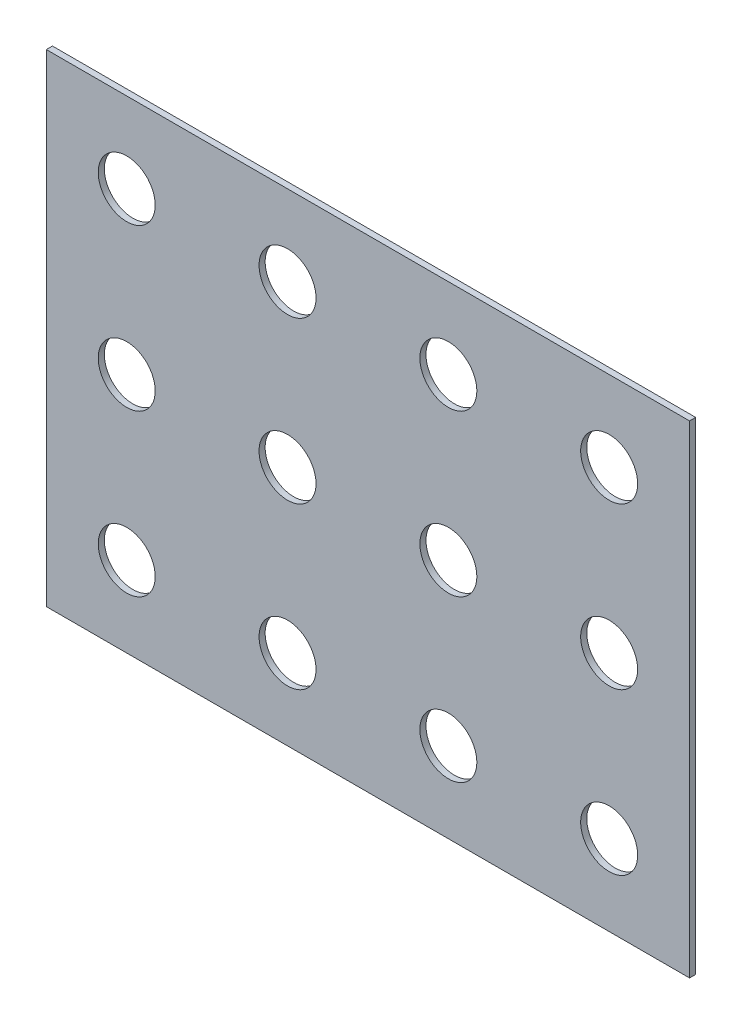
ISO-10303-21;
HEADER;
FILE_DESCRIPTION(('STEP AP214'),'2;1');
FILE_NAME('part.step','',(''),(''),'','','');
FILE_SCHEMA(('AUTOMOTIVE_DESIGN { 1 0 10303 214 1 1 1 1 }'));
ENDSEC;
DATA;
#1=APPLICATION_CONTEXT('core data for automotive mechanical design processes');
#2=APPLICATION_PROTOCOL_DEFINITION('international standard','automotive_design',2000,#1);
#3=PRODUCT_CONTEXT('',#1,'mechanical');
#4=PRODUCT('Part','Part','',(#3));
#5=PRODUCT_RELATED_PRODUCT_CATEGORY('part','',(#4));
#6=PRODUCT_DEFINITION_FORMATION('','',#4);
#7=PRODUCT_DEFINITION_CONTEXT('part definition',#1,'design');
#8=PRODUCT_DEFINITION('design','',#6,#7);
#9=PRODUCT_DEFINITION_SHAPE('','',#8);
#10=(LENGTH_UNIT() NAMED_UNIT(*) SI_UNIT(.MILLI.,.METRE.));
#11=(NAMED_UNIT(*) PLANE_ANGLE_UNIT() SI_UNIT($,.RADIAN.));
#12=(NAMED_UNIT(*) SI_UNIT($,.STERADIAN.) SOLID_ANGLE_UNIT());
#13=UNCERTAINTY_MEASURE_WITH_UNIT(LENGTH_MEASURE(1.E-05),#10,'distance_accuracy_value','');
#14=(GEOMETRIC_REPRESENTATION_CONTEXT(3) GLOBAL_UNCERTAINTY_ASSIGNED_CONTEXT((#13)) GLOBAL_UNIT_ASSIGNED_CONTEXT((#10,
#11,#12)) REPRESENTATION_CONTEXT('',''));
#15=CARTESIAN_POINT('',(0.,0.,0.));
#16=DIRECTION('',(0.,0.,1.));
#17=DIRECTION('',(1.,0.,0.));
#18=AXIS2_PLACEMENT_3D('',#15,#16,#17);
#19=CARTESIAN_POINT('',(0.,0.,0.09652));
#20=DIRECTION('',(0.,0.,1.));
#21=DIRECTION('',(1.,0.,0.));
#22=AXIS2_PLACEMENT_3D('',#19,#20,#21);
#23=PLANE('',#22);
#24=CARTESIAN_POINT('',(8.89,6.35,0.09652));
#25=DIRECTION('',(0.,0.,1.));
#26=DIRECTION('',(1.,0.,0.));
#27=AXIS2_PLACEMENT_3D('',#24,#25,#26);
#28=CIRCLE('',#27,0.4499991);
#29=CARTESIAN_POINT('',(9.3399991,6.35,0.09652));
#30=VERTEX_POINT('',#29);
#31=EDGE_CURVE('E25',#30,#30,#28,.T.);
#32=ORIENTED_EDGE('',*,*,#31,.F.);
#33=EDGE_LOOP('',(#32));
#34=FACE_BOUND('',#33,.T.);
#35=CARTESIAN_POINT('',(8.89,3.81,0.09652));
#36=DIRECTION('',(0.,0.,1.));
#37=DIRECTION('',(1.,0.,0.));
#38=AXIS2_PLACEMENT_3D('',#35,#36,#37);
#39=CIRCLE('',#38,0.4499991);
#40=CARTESIAN_POINT('',(9.3399991,3.81,0.09652));
#41=VERTEX_POINT('',#40);
#42=EDGE_CURVE('E196',#41,#41,#39,.T.);
#43=ORIENTED_EDGE('',*,*,#42,.F.);
#44=EDGE_LOOP('',(#43));
#45=FACE_BOUND('',#44,.T.);
#46=CARTESIAN_POINT('',(6.35,6.35,0.09652));
#47=DIRECTION('',(0.,0.,1.));
#48=DIRECTION('',(1.,0.,0.));
#49=AXIS2_PLACEMENT_3D('',#46,#47,#48);
#50=CIRCLE('',#49,0.4499991);
#51=CARTESIAN_POINT('',(6.7999991,6.35,0.09652));
#52=VERTEX_POINT('',#51);
#53=EDGE_CURVE('E129',#52,#52,#50,.T.);
#54=ORIENTED_EDGE('',*,*,#53,.F.);
#55=EDGE_LOOP('',(#54));
#56=FACE_BOUND('',#55,.T.);
#57=CARTESIAN_POINT('',(6.35,1.27,0.09652));
#58=DIRECTION('',(0.,0.,1.));
#59=DIRECTION('',(1.,0.,0.));
#60=AXIS2_PLACEMENT_3D('',#57,#58,#59);
#61=CIRCLE('',#60,0.4499991);
#62=CARTESIAN_POINT('',(6.7999991,1.27,0.09652));
#63=VERTEX_POINT('',#62);
#64=EDGE_CURVE('E257',#63,#63,#61,.T.);
#65=ORIENTED_EDGE('',*,*,#64,.F.);
#66=EDGE_LOOP('',(#65));
#67=FACE_BOUND('',#66,.T.);
#68=CARTESIAN_POINT('',(8.89,1.27,0.09652));
#69=DIRECTION('',(0.,0.,1.));
#70=DIRECTION('',(1.,0.,0.));
#71=AXIS2_PLACEMENT_3D('',#68,#69,#70);
#72=CIRCLE('',#71,0.4499991);
#73=CARTESIAN_POINT('',(9.3399991,1.27,0.09652));
#74=VERTEX_POINT('',#73);
#75=EDGE_CURVE('E247',#74,#74,#72,.T.);
#76=ORIENTED_EDGE('',*,*,#75,.F.);
#77=EDGE_LOOP('',(#76));
#78=FACE_BOUND('',#77,.T.);
#79=CARTESIAN_POINT('',(6.35,3.81,0.09652));
#80=DIRECTION('',(0.,0.,1.));
#81=DIRECTION('',(1.,0.,0.));
#82=AXIS2_PLACEMENT_3D('',#79,#80,#81);
#83=CIRCLE('',#82,0.4499991);
#84=CARTESIAN_POINT('',(6.7999991,3.81,0.09652));
#85=VERTEX_POINT('',#84);
#86=EDGE_CURVE('E237',#85,#85,#83,.T.);
#87=ORIENTED_EDGE('',*,*,#86,.F.);
#88=EDGE_LOOP('',(#87));
#89=FACE_BOUND('',#88,.T.);
#90=CARTESIAN_POINT('',(3.81,6.35,0.09652));
#91=DIRECTION('',(0.,0.,1.));
#92=DIRECTION('',(1.,0.,0.));
#93=AXIS2_PLACEMENT_3D('',#90,#91,#92);
#94=CIRCLE('',#93,0.4499991);
#95=CARTESIAN_POINT('',(4.2599991,6.35,0.09652));
#96=VERTEX_POINT('',#95);
#97=EDGE_CURVE('E217',#96,#96,#94,.T.);
#98=ORIENTED_EDGE('',*,*,#97,.F.);
#99=EDGE_LOOP('',(#98));
#100=FACE_BOUND('',#99,.T.);
#101=CARTESIAN_POINT('',(3.81,3.81,0.09652));
#102=DIRECTION('',(0.,0.,1.));
#103=DIRECTION('',(1.,0.,0.));
#104=AXIS2_PLACEMENT_3D('',#101,#102,#103);
#105=CIRCLE('',#104,0.4499991);
#106=CARTESIAN_POINT('',(4.2599991,3.81,0.09652));
#107=VERTEX_POINT('',#106);
#108=EDGE_CURVE('E221',#107,#107,#105,.T.);
#109=ORIENTED_EDGE('',*,*,#108,.F.);
#110=EDGE_LOOP('',(#109));
#111=FACE_BOUND('',#110,.T.);
#112=CARTESIAN_POINT('',(1.27,6.35,0.09652));
#113=DIRECTION('',(0.,0.,1.));
#114=DIRECTION('',(1.,0.,0.));
#115=AXIS2_PLACEMENT_3D('',#112,#113,#114);
#116=CIRCLE('',#115,0.4499991);
#117=CARTESIAN_POINT('',(1.7199991,6.35,0.09652));
#118=VERTEX_POINT('',#117);
#119=EDGE_CURVE('E205',#118,#118,#116,.T.);
#120=ORIENTED_EDGE('',*,*,#119,.F.);
#121=EDGE_LOOP('',(#120));
#122=FACE_BOUND('',#121,.T.);
#123=CARTESIAN_POINT('',(1.27,1.27,0.09652));
#124=DIRECTION('',(0.,0.,1.));
#125=DIRECTION('',(1.,0.,0.));
#126=AXIS2_PLACEMENT_3D('',#123,#124,#125);
#127=CIRCLE('',#126,0.4499991);
#128=CARTESIAN_POINT('',(1.7199991,1.27,0.09652));
#129=VERTEX_POINT('',#128);
#130=EDGE_CURVE('E200',#129,#129,#127,.T.);
#131=ORIENTED_EDGE('',*,*,#130,.F.);
#132=EDGE_LOOP('',(#131));
#133=FACE_BOUND('',#132,.T.);
#134=CARTESIAN_POINT('',(3.81,1.27,0.09652));
#135=DIRECTION('',(0.,0.,1.));
#136=DIRECTION('',(1.,0.,0.));
#137=AXIS2_PLACEMENT_3D('',#134,#135,#136);
#138=CIRCLE('',#137,0.4499991);
#139=CARTESIAN_POINT('',(4.2599991,1.27,0.09652));
#140=VERTEX_POINT('',#139);
#141=EDGE_CURVE('E173',#140,#140,#138,.T.);
#142=ORIENTED_EDGE('',*,*,#141,.F.);
#143=EDGE_LOOP('',(#142));
#144=FACE_BOUND('',#143,.T.);
#145=CARTESIAN_POINT('',(1.27,3.81,0.09652));
#146=DIRECTION('',(0.,0.,1.));
#147=DIRECTION('',(1.,0.,0.));
#148=AXIS2_PLACEMENT_3D('',#145,#146,#147);
#149=CIRCLE('',#148,0.4499991);
#150=CARTESIAN_POINT('',(1.7199991,3.81,0.09652));
#151=VERTEX_POINT('',#150);
#152=EDGE_CURVE('E459',#151,#151,#149,.T.);
#153=ORIENTED_EDGE('',*,*,#152,.F.);
#154=EDGE_LOOP('',(#153));
#155=FACE_BOUND('',#154,.T.);
#156=DIRECTION('',(-1.,0.,0.));
#157=VECTOR('',#156,1.);
#158=CARTESIAN_POINT('',(10.159999847412,0.,0.09652));
#159=LINE('',#158,#157);
#160=CARTESIAN_POINT('',(10.159999847412,0.,0.09652));
#161=VERTEX_POINT('',#160);
#162=CARTESIAN_POINT('',(0.,0.,0.09652));
#163=VERTEX_POINT('',#162);
#164=EDGE_CURVE('E440',#161,#163,#159,.T.);
#165=ORIENTED_EDGE('',*,*,#164,.F.);
#166=DIRECTION('',(0.,-1.,0.));
#167=VECTOR('',#166,1.);
#168=CARTESIAN_POINT('',(10.159999847412,7.619999885559,0.09652));
#169=LINE('',#168,#167);
#170=CARTESIAN_POINT('',(10.159999847412,7.619999885559,0.09652));
#171=VERTEX_POINT('',#170);
#172=EDGE_CURVE('E421',#171,#161,#169,.T.);
#173=ORIENTED_EDGE('',*,*,#172,.F.);
#174=DIRECTION('',(1.,0.,0.));
#175=VECTOR('',#174,1.);
#176=CARTESIAN_POINT('',(0.,7.619999885559,0.09652));
#177=LINE('',#176,#175);
#178=CARTESIAN_POINT('',(0.,7.619999885559,0.09652));
#179=VERTEX_POINT('',#178);
#180=EDGE_CURVE('E395',#179,#171,#177,.T.);
#181=ORIENTED_EDGE('',*,*,#180,.F.);
#182=DIRECTION('',(0.,1.,0.));
#183=VECTOR('',#182,1.);
#184=CARTESIAN_POINT('',(0.,0.,0.09652));
#185=LINE('',#184,#183);
#186=EDGE_CURVE('E387',#163,#179,#185,.T.);
#187=ORIENTED_EDGE('',*,*,#186,.F.);
#188=EDGE_LOOP('',(#165,#173,#181,#187));
#189=FACE_BOUND('',#188,.T.);
#190=ADVANCED_FACE('F17',(#34,#45,#56,#67,#78,#89,#100,#111,#122,#133,#144,#155,#189),#23,.T.);
#191=CARTESIAN_POINT('',(0.,0.,0.));
#192=DIRECTION('',(0.,0.,1.));
#193=DIRECTION('',(1.,0.,0.));
#194=AXIS2_PLACEMENT_3D('',#191,#192,#193);
#195=PLANE('',#194);
#196=CARTESIAN_POINT('',(8.89,6.35,0.));
#197=DIRECTION('',(0.,0.,1.));
#198=DIRECTION('',(1.,0.,0.));
#199=AXIS2_PLACEMENT_3D('',#196,#197,#198);
#200=CIRCLE('',#199,0.4499991);
#201=CARTESIAN_POINT('',(9.3399991,6.35,0.));
#202=VERTEX_POINT('',#201);
#203=EDGE_CURVE('E11',#202,#202,#200,.T.);
#204=ORIENTED_EDGE('',*,*,#203,.T.);
#205=EDGE_LOOP('',(#204));
#206=FACE_BOUND('',#205,.T.);
#207=CARTESIAN_POINT('',(8.89,3.81,0.));
#208=DIRECTION('',(0.,0.,1.));
#209=DIRECTION('',(1.,0.,0.));
#210=AXIS2_PLACEMENT_3D('',#207,#208,#209);
#211=CIRCLE('',#210,0.4499991);
#212=CARTESIAN_POINT('',(9.3399991,3.81,0.));
#213=VERTEX_POINT('',#212);
#214=EDGE_CURVE('E138',#213,#213,#211,.T.);
#215=ORIENTED_EDGE('',*,*,#214,.T.);
#216=EDGE_LOOP('',(#215));
#217=FACE_BOUND('',#216,.T.);
#218=CARTESIAN_POINT('',(6.35,6.35,0.));
#219=DIRECTION('',(0.,0.,1.));
#220=DIRECTION('',(1.,0.,0.));
#221=AXIS2_PLACEMENT_3D('',#218,#219,#220);
#222=CIRCLE('',#221,0.4499991);
#223=CARTESIAN_POINT('',(6.7999991,6.35,0.));
#224=VERTEX_POINT('',#223);
#225=EDGE_CURVE('E228',#224,#224,#222,.T.);
#226=ORIENTED_EDGE('',*,*,#225,.T.);
#227=EDGE_LOOP('',(#226));
#228=FACE_BOUND('',#227,.T.);
#229=CARTESIAN_POINT('',(6.35,1.27,0.));
#230=DIRECTION('',(0.,0.,1.));
#231=DIRECTION('',(1.,0.,0.));
#232=AXIS2_PLACEMENT_3D('',#229,#230,#231);
#233=CIRCLE('',#232,0.4499991);
#234=CARTESIAN_POINT('',(6.7999991,1.27,0.));
#235=VERTEX_POINT('',#234);
#236=EDGE_CURVE('E260',#235,#235,#233,.T.);
#237=ORIENTED_EDGE('',*,*,#236,.T.);
#238=EDGE_LOOP('',(#237));
#239=FACE_BOUND('',#238,.T.);
#240=CARTESIAN_POINT('',(8.89,1.27,0.));
#241=DIRECTION('',(0.,0.,1.));
#242=DIRECTION('',(1.,0.,0.));
#243=AXIS2_PLACEMENT_3D('',#240,#241,#242);
#244=CIRCLE('',#243,0.4499991);
#245=CARTESIAN_POINT('',(9.3399991,1.27,0.));
#246=VERTEX_POINT('',#245);
#247=EDGE_CURVE('E250',#246,#246,#244,.T.);
#248=ORIENTED_EDGE('',*,*,#247,.T.);
#249=EDGE_LOOP('',(#248));
#250=FACE_BOUND('',#249,.T.);
#251=CARTESIAN_POINT('',(6.35,3.81,0.));
#252=DIRECTION('',(0.,0.,1.));
#253=DIRECTION('',(1.,0.,0.));
#254=AXIS2_PLACEMENT_3D('',#251,#252,#253);
#255=CIRCLE('',#254,0.4499991);
#256=CARTESIAN_POINT('',(6.7999991,3.81,0.));
#257=VERTEX_POINT('',#256);
#258=EDGE_CURVE('E240',#257,#257,#255,.T.);
#259=ORIENTED_EDGE('',*,*,#258,.T.);
#260=EDGE_LOOP('',(#259));
#261=FACE_BOUND('',#260,.T.);
#262=CARTESIAN_POINT('',(3.81,6.35,0.));
#263=DIRECTION('',(0.,0.,1.));
#264=DIRECTION('',(1.,0.,0.));
#265=AXIS2_PLACEMENT_3D('',#262,#263,#264);
#266=CIRCLE('',#265,0.4499991);
#267=CARTESIAN_POINT('',(4.2599991,6.35,0.));
#268=VERTEX_POINT('',#267);
#269=EDGE_CURVE('E213',#268,#268,#266,.T.);
#270=ORIENTED_EDGE('',*,*,#269,.T.);
#271=EDGE_LOOP('',(#270));
#272=FACE_BOUND('',#271,.T.);
#273=CARTESIAN_POINT('',(3.81,3.81,0.));
#274=DIRECTION('',(0.,0.,1.));
#275=DIRECTION('',(1.,0.,0.));
#276=AXIS2_PLACEMENT_3D('',#273,#274,#275);
#277=CIRCLE('',#276,0.4499991);
#278=CARTESIAN_POINT('',(4.2599991,3.81,0.));
#279=VERTEX_POINT('',#278);
#280=EDGE_CURVE('E224',#279,#279,#277,.T.);
#281=ORIENTED_EDGE('',*,*,#280,.T.);
#282=EDGE_LOOP('',(#281));
#283=FACE_BOUND('',#282,.T.);
#284=CARTESIAN_POINT('',(1.27,6.35,0.));
#285=DIRECTION('',(0.,0.,1.));
#286=DIRECTION('',(1.,0.,0.));
#287=AXIS2_PLACEMENT_3D('',#284,#285,#286);
#288=CIRCLE('',#287,0.4499991);
#289=CARTESIAN_POINT('',(1.7199991,6.35,0.));
#290=VERTEX_POINT('',#289);
#291=EDGE_CURVE('E209',#290,#290,#288,.T.);
#292=ORIENTED_EDGE('',*,*,#291,.T.);
#293=EDGE_LOOP('',(#292));
#294=FACE_BOUND('',#293,.T.);
#295=CARTESIAN_POINT('',(1.27,1.27,0.));
#296=DIRECTION('',(0.,0.,1.));
#297=DIRECTION('',(1.,0.,0.));
#298=AXIS2_PLACEMENT_3D('',#295,#296,#297);
#299=CIRCLE('',#298,0.4499991);
#300=CARTESIAN_POINT('',(1.7199991,1.27,0.));
#301=VERTEX_POINT('',#300);
#302=EDGE_CURVE('E206',#301,#301,#299,.T.);
#303=ORIENTED_EDGE('',*,*,#302,.T.);
#304=EDGE_LOOP('',(#303));
#305=FACE_BOUND('',#304,.T.);
#306=CARTESIAN_POINT('',(3.81,1.27,0.));
#307=DIRECTION('',(0.,0.,1.));
#308=DIRECTION('',(1.,0.,0.));
#309=AXIS2_PLACEMENT_3D('',#306,#307,#308);
#310=CIRCLE('',#309,0.4499991);
#311=CARTESIAN_POINT('',(4.2599991,1.27,0.));
#312=VERTEX_POINT('',#311);
#313=EDGE_CURVE('E179',#312,#312,#310,.T.);
#314=ORIENTED_EDGE('',*,*,#313,.T.);
#315=EDGE_LOOP('',(#314));
#316=FACE_BOUND('',#315,.T.);
#317=CARTESIAN_POINT('',(1.27,3.81,0.));
#318=DIRECTION('',(0.,0.,1.));
#319=DIRECTION('',(1.,0.,0.));
#320=AXIS2_PLACEMENT_3D('',#317,#318,#319);
#321=CIRCLE('',#320,0.4499991);
#322=CARTESIAN_POINT('',(1.7199991,3.81,0.));
#323=VERTEX_POINT('',#322);
#324=EDGE_CURVE('E188',#323,#323,#321,.T.);
#325=ORIENTED_EDGE('',*,*,#324,.T.);
#326=EDGE_LOOP('',(#325));
#327=FACE_BOUND('',#326,.T.);
#328=DIRECTION('',(0.,1.,0.));
#329=VECTOR('',#328,1.);
#330=CARTESIAN_POINT('',(0.,0.,0.));
#331=LINE('',#330,#329);
#332=CARTESIAN_POINT('',(0.,0.,0.));
#333=VERTEX_POINT('',#332);
#334=CARTESIAN_POINT('',(0.,7.619999885559,0.));
#335=VERTEX_POINT('',#334);
#336=EDGE_CURVE('E390',#333,#335,#331,.T.);
#337=ORIENTED_EDGE('',*,*,#336,.T.);
#338=DIRECTION('',(1.,0.,0.));
#339=VECTOR('',#338,1.);
#340=CARTESIAN_POINT('',(0.,7.619999885559,0.));
#341=LINE('',#340,#339);
#342=CARTESIAN_POINT('',(10.159999847412,7.619999885559,0.));
#343=VERTEX_POINT('',#342);
#344=EDGE_CURVE('E415',#335,#343,#341,.T.);
#345=ORIENTED_EDGE('',*,*,#344,.T.);
#346=DIRECTION('',(0.,-1.,0.));
#347=VECTOR('',#346,1.);
#348=CARTESIAN_POINT('',(10.159999847412,7.619999885559,0.));
#349=LINE('',#348,#347);
#350=CARTESIAN_POINT('',(10.159999847412,0.,0.));
#351=VERTEX_POINT('',#350);
#352=EDGE_CURVE('E433',#343,#351,#349,.T.);
#353=ORIENTED_EDGE('',*,*,#352,.T.);
#354=DIRECTION('',(-1.,0.,0.));
#355=VECTOR('',#354,1.);
#356=CARTESIAN_POINT('',(10.159999847412,0.,0.));
#357=LINE('',#356,#355);
#358=EDGE_CURVE('E446',#351,#333,#357,.T.);
#359=ORIENTED_EDGE('',*,*,#358,.T.);
#360=EDGE_LOOP('',(#337,#345,#353,#359));
#361=FACE_BOUND('',#360,.T.);
#362=ADVANCED_FACE('F474',(#206,#217,#228,#239,#250,#261,#272,#283,#294,#305,#316,#327,#361),
#195,.F.);
#363=CARTESIAN_POINT('',(8.89,6.35,0.));
#364=DIRECTION('',(0.,0.,-1.));
#365=DIRECTION('',(1.,0.,0.));
#366=AXIS2_PLACEMENT_3D('',#363,#364,#365);
#367=CYLINDRICAL_SURFACE('',#366,0.4499991);
#368=DIRECTION('',(0.,0.,1.));
#369=VECTOR('',#368,1.);
#370=CARTESIAN_POINT('',(9.3399991,6.35,0.));
#371=LINE('',#370,#369);
#372=EDGE_CURVE('E195',#202,#30,#371,.T.);
#373=ORIENTED_EDGE('',*,*,#372,.T.);
#374=ORIENTED_EDGE('',*,*,#31,.T.);
#375=ORIENTED_EDGE('',*,*,#372,.F.);
#376=ORIENTED_EDGE('',*,*,#203,.F.);
#377=EDGE_LOOP('',(#373,#374,#375,#376));
#378=FACE_BOUND('',#377,.T.);
#379=ADVANCED_FACE('F509',(#378),#367,.F.);
#380=CARTESIAN_POINT('',(8.89,3.81,0.));
#381=DIRECTION('',(0.,0.,-1.));
#382=DIRECTION('',(1.,0.,0.));
#383=AXIS2_PLACEMENT_3D('',#380,#381,#382);
#384=CYLINDRICAL_SURFACE('',#383,0.4499991);
#385=DIRECTION('',(0.,0.,1.));
#386=VECTOR('',#385,1.);
#387=CARTESIAN_POINT('',(9.3399991,3.81,0.));
#388=LINE('',#387,#386);
#389=EDGE_CURVE('E231',#213,#41,#388,.T.);
#390=ORIENTED_EDGE('',*,*,#389,.T.);
#391=ORIENTED_EDGE('',*,*,#42,.T.);
#392=ORIENTED_EDGE('',*,*,#389,.F.);
#393=ORIENTED_EDGE('',*,*,#214,.F.);
#394=EDGE_LOOP('',(#390,#391,#392,#393));
#395=FACE_BOUND('',#394,.T.);
#396=ADVANCED_FACE('F514',(#395),#384,.F.);
#397=CARTESIAN_POINT('',(6.35,6.35,0.));
#398=DIRECTION('',(0.,0.,-1.));
#399=DIRECTION('',(1.,0.,0.));
#400=AXIS2_PLACEMENT_3D('',#397,#398,#399);
#401=CYLINDRICAL_SURFACE('',#400,0.4499991);
#402=DIRECTION('',(0.,0.,1.));
#403=VECTOR('',#402,1.);
#404=CARTESIAN_POINT('',(6.7999991,6.35,0.));
#405=LINE('',#404,#403);
#406=EDGE_CURVE('E261',#224,#52,#405,.T.);
#407=ORIENTED_EDGE('',*,*,#406,.T.);
#408=ORIENTED_EDGE('',*,*,#53,.T.);
#409=ORIENTED_EDGE('',*,*,#406,.F.);
#410=ORIENTED_EDGE('',*,*,#225,.F.);
#411=EDGE_LOOP('',(#407,#408,#409,#410));
#412=FACE_BOUND('',#411,.T.);
#413=ADVANCED_FACE('F517',(#412),#401,.F.);
#414=CARTESIAN_POINT('',(6.35,1.27,0.));
#415=DIRECTION('',(0.,0.,-1.));
#416=DIRECTION('',(1.,0.,0.));
#417=AXIS2_PLACEMENT_3D('',#414,#415,#416);
#418=CYLINDRICAL_SURFACE('',#417,0.4499991);
#419=DIRECTION('',(0.,0.,1.));
#420=VECTOR('',#419,1.);
#421=CARTESIAN_POINT('',(6.7999991,1.27,0.));
#422=LINE('',#421,#420);
#423=EDGE_CURVE('E253',#235,#63,#422,.T.);
#424=ORIENTED_EDGE('',*,*,#423,.T.);
#425=ORIENTED_EDGE('',*,*,#64,.T.);
#426=ORIENTED_EDGE('',*,*,#423,.F.);
#427=ORIENTED_EDGE('',*,*,#236,.F.);
#428=EDGE_LOOP('',(#424,#425,#426,#427));
#429=FACE_BOUND('',#428,.T.);
#430=ADVANCED_FACE('F520',(#429),#418,.F.);
#431=CARTESIAN_POINT('',(8.89,1.27,0.));
#432=DIRECTION('',(0.,0.,-1.));
#433=DIRECTION('',(1.,0.,0.));
#434=AXIS2_PLACEMENT_3D('',#431,#432,#433);
#435=CYLINDRICAL_SURFACE('',#434,0.4499991);
#436=DIRECTION('',(0.,0.,1.));
#437=VECTOR('',#436,1.);
#438=CARTESIAN_POINT('',(9.3399991,1.27,0.));
#439=LINE('',#438,#437);
#440=EDGE_CURVE('E243',#246,#74,#439,.T.);
#441=ORIENTED_EDGE('',*,*,#440,.T.);
#442=ORIENTED_EDGE('',*,*,#75,.T.);
#443=ORIENTED_EDGE('',*,*,#440,.F.);
#444=ORIENTED_EDGE('',*,*,#247,.F.);
#445=EDGE_LOOP('',(#441,#442,#443,#444));
#446=FACE_BOUND('',#445,.T.);
#447=ADVANCED_FACE('F521',(#446),#435,.F.);
#448=CARTESIAN_POINT('',(6.35,3.81,0.));
#449=DIRECTION('',(0.,0.,-1.));
#450=DIRECTION('',(1.,0.,0.));
#451=AXIS2_PLACEMENT_3D('',#448,#449,#450);
#452=CYLINDRICAL_SURFACE('',#451,0.4499991);
#453=DIRECTION('',(0.,0.,1.));
#454=VECTOR('',#453,1.);
#455=CARTESIAN_POINT('',(6.7999991,3.81,0.));
#456=LINE('',#455,#454);
#457=EDGE_CURVE('E216',#257,#85,#456,.T.);
#458=ORIENTED_EDGE('',*,*,#457,.T.);
#459=ORIENTED_EDGE('',*,*,#86,.T.);
#460=ORIENTED_EDGE('',*,*,#457,.F.);
#461=ORIENTED_EDGE('',*,*,#258,.F.);
#462=EDGE_LOOP('',(#458,#459,#460,#461));
#463=FACE_BOUND('',#462,.T.);
#464=ADVANCED_FACE('F524',(#463),#452,.F.);
#465=CARTESIAN_POINT('',(3.81,6.35,0.));
#466=DIRECTION('',(0.,0.,-1.));
#467=DIRECTION('',(1.,0.,0.));
#468=AXIS2_PLACEMENT_3D('',#465,#466,#467);
#469=CYLINDRICAL_SURFACE('',#468,0.4499991);
#470=DIRECTION('',(0.,0.,1.));
#471=VECTOR('',#470,1.);
#472=CARTESIAN_POINT('',(4.2599991,6.35,0.));
#473=LINE('',#472,#471);
#474=EDGE_CURVE('E227',#268,#96,#473,.T.);
#475=ORIENTED_EDGE('',*,*,#474,.T.);
#476=ORIENTED_EDGE('',*,*,#97,.T.);
#477=ORIENTED_EDGE('',*,*,#474,.F.);
#478=ORIENTED_EDGE('',*,*,#269,.F.);
#479=EDGE_LOOP('',(#475,#476,#477,#478));
#480=FACE_BOUND('',#479,.T.);
#481=ADVANCED_FACE('F526',(#480),#469,.F.);
#482=CARTESIAN_POINT('',(3.81,3.81,0.));
#483=DIRECTION('',(0.,0.,-1.));
#484=DIRECTION('',(1.,0.,0.));
#485=AXIS2_PLACEMENT_3D('',#482,#483,#484);
#486=CYLINDRICAL_SURFACE('',#485,0.4499991);
#487=DIRECTION('',(0.,0.,1.));
#488=VECTOR('',#487,1.);
#489=CARTESIAN_POINT('',(4.2599991,3.81,0.));
#490=LINE('',#489,#488);
#491=EDGE_CURVE('E212',#279,#107,#490,.T.);
#492=ORIENTED_EDGE('',*,*,#491,.T.);
#493=ORIENTED_EDGE('',*,*,#108,.T.);
#494=ORIENTED_EDGE('',*,*,#491,.F.);
#495=ORIENTED_EDGE('',*,*,#280,.F.);
#496=EDGE_LOOP('',(#492,#493,#494,#495));
#497=FACE_BOUND('',#496,.T.);
#498=ADVANCED_FACE('F529',(#497),#486,.F.);
#499=CARTESIAN_POINT('',(1.27,6.35,0.));
#500=DIRECTION('',(0.,0.,-1.));
#501=DIRECTION('',(1.,0.,0.));
#502=AXIS2_PLACEMENT_3D('',#499,#500,#501);
#503=CYLINDRICAL_SURFACE('',#502,0.4499991);
#504=DIRECTION('',(0.,0.,1.));
#505=VECTOR('',#504,1.);
#506=CARTESIAN_POINT('',(1.7199991,6.35,0.));
#507=LINE('',#506,#505);
#508=EDGE_CURVE('E201',#290,#118,#507,.T.);
#509=ORIENTED_EDGE('',*,*,#508,.T.);
#510=ORIENTED_EDGE('',*,*,#119,.T.);
#511=ORIENTED_EDGE('',*,*,#508,.F.);
#512=ORIENTED_EDGE('',*,*,#291,.F.);
#513=EDGE_LOOP('',(#509,#510,#511,#512));
#514=FACE_BOUND('',#513,.T.);
#515=ADVANCED_FACE('F537',(#514),#503,.F.);
#516=CARTESIAN_POINT('',(1.27,1.27,0.));
#517=DIRECTION('',(0.,0.,-1.));
#518=DIRECTION('',(1.,0.,0.));
#519=AXIS2_PLACEMENT_3D('',#516,#517,#518);
#520=CYLINDRICAL_SURFACE('',#519,0.4499991);
#521=DIRECTION('',(0.,0.,1.));
#522=VECTOR('',#521,1.);
#523=CARTESIAN_POINT('',(1.7199991,1.27,0.));
#524=LINE('',#523,#522);
#525=EDGE_CURVE('E186',#301,#129,#524,.T.);
#526=ORIENTED_EDGE('',*,*,#525,.T.);
#527=ORIENTED_EDGE('',*,*,#130,.T.);
#528=ORIENTED_EDGE('',*,*,#525,.F.);
#529=ORIENTED_EDGE('',*,*,#302,.F.);
#530=EDGE_LOOP('',(#526,#527,#528,#529));
#531=FACE_BOUND('',#530,.T.);
#532=ADVANCED_FACE('F534',(#531),#520,.F.);
#533=CARTESIAN_POINT('',(3.81,1.27,0.));
#534=DIRECTION('',(0.,0.,-1.));
#535=DIRECTION('',(1.,0.,0.));
#536=AXIS2_PLACEMENT_3D('',#533,#534,#535);
#537=CYLINDRICAL_SURFACE('',#536,0.4499991);
#538=DIRECTION('',(0.,0.,1.));
#539=VECTOR('',#538,1.);
#540=CARTESIAN_POINT('',(4.2599991,1.27,0.));
#541=LINE('',#540,#539);
#542=EDGE_CURVE('E176',#312,#140,#541,.T.);
#543=ORIENTED_EDGE('',*,*,#542,.T.);
#544=ORIENTED_EDGE('',*,*,#141,.T.);
#545=ORIENTED_EDGE('',*,*,#542,.F.);
#546=ORIENTED_EDGE('',*,*,#313,.F.);
#547=EDGE_LOOP('',(#543,#544,#545,#546));
#548=FACE_BOUND('',#547,.T.);
#549=ADVANCED_FACE('F174',(#548),#537,.F.);
#550=CARTESIAN_POINT('',(1.27,3.81,0.));
#551=DIRECTION('',(0.,0.,-1.));
#552=DIRECTION('',(1.,0.,0.));
#553=AXIS2_PLACEMENT_3D('',#550,#551,#552);
#554=CYLINDRICAL_SURFACE('',#553,0.4499991);
#555=DIRECTION('',(0.,0.,1.));
#556=VECTOR('',#555,1.);
#557=CARTESIAN_POINT('',(1.7199991,3.81,0.));
#558=LINE('',#557,#556);
#559=EDGE_CURVE('E452',#323,#151,#558,.T.);
#560=ORIENTED_EDGE('',*,*,#559,.T.);
#561=ORIENTED_EDGE('',*,*,#152,.T.);
#562=ORIENTED_EDGE('',*,*,#559,.F.);
#563=ORIENTED_EDGE('',*,*,#324,.F.);
#564=EDGE_LOOP('',(#560,#561,#562,#563));
#565=FACE_BOUND('',#564,.T.);
#566=ADVANCED_FACE('F478',(#565),#554,.F.);
#567=CARTESIAN_POINT('',(10.159999847412,0.,0.));
#568=DIRECTION('',(0.,-1.,0.));
#569=DIRECTION('',(0.,0.,-1.));
#570=AXIS2_PLACEMENT_3D('',#567,#568,#569);
#571=PLANE('',#570);
#572=DIRECTION('',(0.,0.,1.));
#573=VECTOR('',#572,1.);
#574=CARTESIAN_POINT('',(10.159999847412,0.,0.));
#575=LINE('',#574,#573);
#576=EDGE_CURVE('E427',#351,#161,#575,.T.);
#577=ORIENTED_EDGE('',*,*,#576,.T.);
#578=ORIENTED_EDGE('',*,*,#164,.T.);
#579=DIRECTION('',(0.,0.,1.));
#580=VECTOR('',#579,1.);
#581=CARTESIAN_POINT('',(0.,0.,0.));
#582=LINE('',#581,#580);
#583=EDGE_CURVE('E501',#333,#163,#582,.T.);
#584=ORIENTED_EDGE('',*,*,#583,.F.);
#585=ORIENTED_EDGE('',*,*,#358,.F.);
#586=EDGE_LOOP('',(#577,#578,#584,#585));
#587=FACE_BOUND('',#586,.T.);
#588=ADVANCED_FACE('F491',(#587),#571,.T.);
#589=CARTESIAN_POINT('',(10.159999847412,7.619999885559,0.));
#590=DIRECTION('',(1.,0.,0.));
#591=DIRECTION('',(0.,1.,0.));
#592=AXIS2_PLACEMENT_3D('',#589,#590,#591);
#593=PLANE('',#592);
#594=DIRECTION('',(0.,0.,1.));
#595=VECTOR('',#594,1.);
#596=CARTESIAN_POINT('',(10.159999847412,7.619999885559,0.));
#597=LINE('',#596,#595);
#598=EDGE_CURVE('E407',#343,#171,#597,.T.);
#599=ORIENTED_EDGE('',*,*,#598,.T.);
#600=ORIENTED_EDGE('',*,*,#172,.T.);
#601=ORIENTED_EDGE('',*,*,#576,.F.);
#602=ORIENTED_EDGE('',*,*,#352,.F.);
#603=EDGE_LOOP('',(#599,#600,#601,#602));
#604=FACE_BOUND('',#603,.T.);
#605=ADVANCED_FACE('F493',(#604),#593,.T.);
#606=CARTESIAN_POINT('',(0.,7.619999885559,0.));
#607=DIRECTION('',(0.,1.,0.));
#608=DIRECTION('',(1.,0.,0.));
#609=AXIS2_PLACEMENT_3D('',#606,#607,#608);
#610=PLANE('',#609);
#611=DIRECTION('',(0.,0.,1.));
#612=VECTOR('',#611,1.);
#613=CARTESIAN_POINT('',(0.,7.619999885559,0.));
#614=LINE('',#613,#612);
#615=EDGE_CURVE('E396',#335,#179,#614,.T.);
#616=ORIENTED_EDGE('',*,*,#615,.T.);
#617=ORIENTED_EDGE('',*,*,#180,.T.);
#618=ORIENTED_EDGE('',*,*,#598,.F.);
#619=ORIENTED_EDGE('',*,*,#344,.F.);
#620=EDGE_LOOP('',(#616,#617,#618,#619));
#621=FACE_BOUND('',#620,.T.);
#622=ADVANCED_FACE('F496',(#621),#610,.T.);
#623=CARTESIAN_POINT('',(0.,0.,0.));
#624=DIRECTION('',(-1.,0.,0.));
#625=DIRECTION('',(0.,0.,1.));
#626=AXIS2_PLACEMENT_3D('',#623,#624,#625);
#627=PLANE('',#626);
#628=ORIENTED_EDGE('',*,*,#583,.T.);
#629=ORIENTED_EDGE('',*,*,#186,.T.);
#630=ORIENTED_EDGE('',*,*,#615,.F.);
#631=ORIENTED_EDGE('',*,*,#336,.F.);
#632=EDGE_LOOP('',(#628,#629,#630,#631));
#633=FACE_BOUND('',#632,.T.);
#634=ADVANCED_FACE('F500',(#633),#627,.T.);
#635=CLOSED_SHELL('',(#190,#362,#379,#396,#413,#430,#447,#464,#481,#498,#515,#532,#549,#566,
#588,#605,#622,#634));
#636=MANIFOLD_SOLID_BREP('B1',#635);
#637=ADVANCED_BREP_SHAPE_REPRESENTATION('',(#18,#636),#14);
#638=SHAPE_DEFINITION_REPRESENTATION(#9,#637);
ENDSEC;
END-ISO-10303-21;
